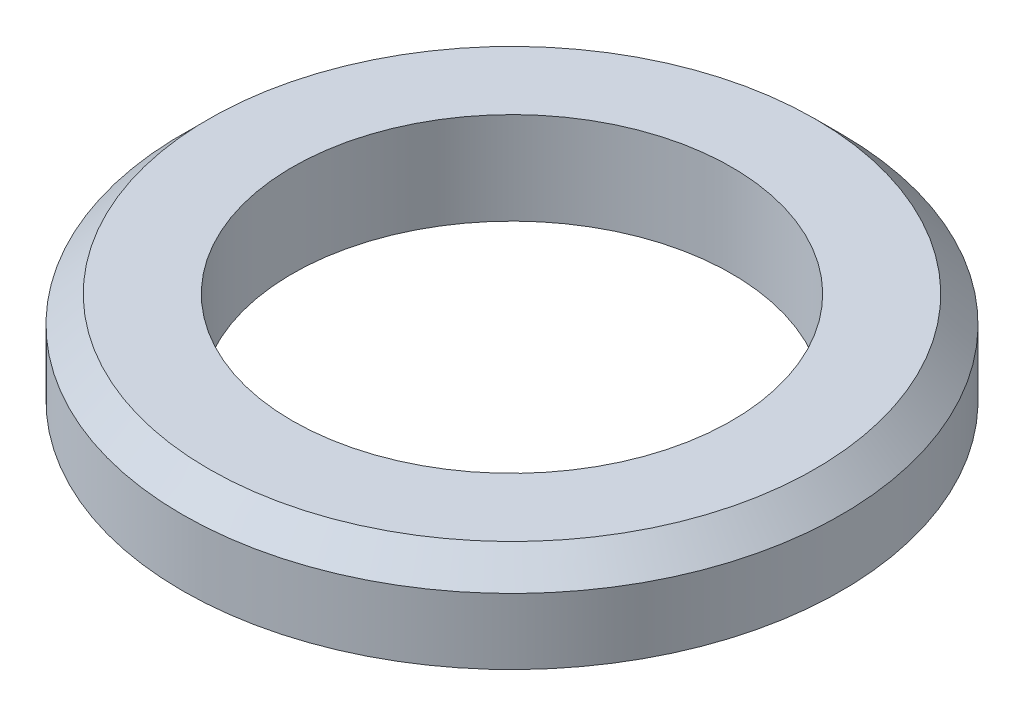
ISO-10303-21;
HEADER;
FILE_DESCRIPTION(('STEP AP214'),'2;1');
FILE_NAME('part.step','',(''),(''),'','','');
FILE_SCHEMA(('AUTOMOTIVE_DESIGN { 1 0 10303 214 1 1 1 1 }'));
ENDSEC;
DATA;
#1=APPLICATION_CONTEXT('core data for automotive mechanical design processes');
#2=APPLICATION_PROTOCOL_DEFINITION('international standard','automotive_design',2000,#1);
#3=PRODUCT_CONTEXT('',#1,'mechanical');
#4=PRODUCT('Part','Part','',(#3));
#5=PRODUCT_RELATED_PRODUCT_CATEGORY('part','',(#4));
#6=PRODUCT_DEFINITION_FORMATION('','',#4);
#7=PRODUCT_DEFINITION_CONTEXT('part definition',#1,'design');
#8=PRODUCT_DEFINITION('design','',#6,#7);
#9=PRODUCT_DEFINITION_SHAPE('','',#8);
#10=(LENGTH_UNIT() NAMED_UNIT(*) SI_UNIT(.MILLI.,.METRE.));
#11=(NAMED_UNIT(*) PLANE_ANGLE_UNIT() SI_UNIT($,.RADIAN.));
#12=(NAMED_UNIT(*) SI_UNIT($,.STERADIAN.) SOLID_ANGLE_UNIT());
#13=UNCERTAINTY_MEASURE_WITH_UNIT(LENGTH_MEASURE(1.E-05),#10,'distance_accuracy_value','');
#14=(GEOMETRIC_REPRESENTATION_CONTEXT(3) GLOBAL_UNCERTAINTY_ASSIGNED_CONTEXT((#13)) GLOBAL_UNIT_ASSIGNED_CONTEXT((#10,
#11,#12)) REPRESENTATION_CONTEXT('',''));
#15=CARTESIAN_POINT('',(0.,0.,0.));
#16=DIRECTION('',(0.,0.,1.));
#17=DIRECTION('',(1.,0.,0.));
#18=AXIS2_PLACEMENT_3D('',#15,#16,#17);
#19=CARTESIAN_POINT('',(0.,0.21,0.));
#20=DIRECTION('',(0.,1.,0.));
#21=DIRECTION('',(0.,0.,1.));
#22=AXIS2_PLACEMENT_3D('',#19,#20,#21);
#23=PLANE('',#22);
#24=CARTESIAN_POINT('',(0.,0.21,0.));
#25=DIRECTION('',(0.,1.,0.));
#26=DIRECTION('',(0.,0.,1.));
#27=AXIS2_PLACEMENT_3D('',#24,#25,#26);
#28=CIRCLE('',#27,0.69);
#29=CARTESIAN_POINT('',(0.,0.21,0.69));
#30=VERTEX_POINT('',#29);
#31=EDGE_CURVE('E37',#30,#30,#28,.T.);
#32=ORIENTED_EDGE('',*,*,#31,.T.);
#33=EDGE_LOOP('',(#32));
#34=FACE_BOUND('',#33,.T.);
#35=CARTESIAN_POINT('',(0.,0.21,0.));
#36=DIRECTION('',(0.,1.,0.));
#37=DIRECTION('',(0.,0.,1.));
#38=AXIS2_PLACEMENT_3D('',#35,#36,#37);
#39=CIRCLE('',#38,0.5);
#40=CARTESIAN_POINT('',(0.,0.21,0.5));
#41=VERTEX_POINT('',#40);
#42=EDGE_CURVE('E45',#41,#41,#39,.T.);
#43=ORIENTED_EDGE('',*,*,#42,.F.);
#44=EDGE_LOOP('',(#43));
#45=FACE_BOUND('',#44,.T.);
#46=ADVANCED_FACE('F30',(#34,#45),#23,.T.);
#47=CARTESIAN_POINT('',(0.,0.,0.));
#48=DIRECTION('',(0.,1.,0.));
#49=DIRECTION('',(0.,0.,1.));
#50=AXIS2_PLACEMENT_3D('',#47,#48,#49);
#51=PLANE('',#50);
#52=CARTESIAN_POINT('',(0.,0.,0.));
#53=DIRECTION('',(0.,1.,0.));
#54=DIRECTION('',(0.,0.,1.));
#55=AXIS2_PLACEMENT_3D('',#52,#53,#54);
#56=CIRCLE('',#55,0.75);
#57=CARTESIAN_POINT('',(0.,0.,0.75));
#58=VERTEX_POINT('',#57);
#59=EDGE_CURVE('E41',#58,#58,#56,.T.);
#60=ORIENTED_EDGE('',*,*,#59,.F.);
#61=EDGE_LOOP('',(#60));
#62=FACE_BOUND('',#61,.T.);
#63=CARTESIAN_POINT('',(0.,0.,0.));
#64=DIRECTION('',(0.,1.,0.));
#65=DIRECTION('',(0.,0.,1.));
#66=AXIS2_PLACEMENT_3D('',#63,#64,#65);
#67=CIRCLE('',#66,0.5);
#68=CARTESIAN_POINT('',(0.,0.,0.5));
#69=VERTEX_POINT('',#68);
#70=EDGE_CURVE('E48',#69,#69,#67,.T.);
#71=ORIENTED_EDGE('',*,*,#70,.T.);
#72=EDGE_LOOP('',(#71));
#73=FACE_BOUND('',#72,.T.);
#74=ADVANCED_FACE('F58',(#62,#73),#51,.F.);
#75=CARTESIAN_POINT('',(0.,0.21,0.));
#76=DIRECTION('',(0.,-1.,0.));
#77=DIRECTION('',(0.,0.,-1.));
#78=AXIS2_PLACEMENT_3D('',#75,#76,#77);
#79=CYLINDRICAL_SURFACE('',#78,0.75);
#80=CARTESIAN_POINT('',(0.,0.15,0.));
#81=DIRECTION('',(0.,1.,0.));
#82=DIRECTION('',(0.,0.,1.));
#83=AXIS2_PLACEMENT_3D('',#80,#81,#82);
#84=CIRCLE('',#83,0.75);
#85=CARTESIAN_POINT('',(0.,0.15,0.75));
#86=VERTEX_POINT('',#85);
#87=EDGE_CURVE('E10',#86,#86,#84,.F.);
#88=ORIENTED_EDGE('',*,*,#87,.T.);
#89=EDGE_LOOP('',(#88));
#90=FACE_BOUND('',#89,.T.);
#91=ORIENTED_EDGE('',*,*,#59,.T.);
#92=EDGE_LOOP('',(#91));
#93=FACE_BOUND('',#92,.T.);
#94=ADVANCED_FACE('F63',(#90,#93),#79,.T.);
#95=CARTESIAN_POINT('',(0.,0.21,0.));
#96=DIRECTION('',(0.,-1.,0.));
#97=DIRECTION('',(0.,0.,-1.));
#98=AXIS2_PLACEMENT_3D('',#95,#96,#97);
#99=CYLINDRICAL_SURFACE('',#98,0.5);
#100=ORIENTED_EDGE('',*,*,#42,.T.);
#101=EDGE_LOOP('',(#100));
#102=FACE_BOUND('',#101,.T.);
#103=ORIENTED_EDGE('',*,*,#70,.F.);
#104=EDGE_LOOP('',(#103));
#105=FACE_BOUND('',#104,.T.);
#106=ADVANCED_FACE('F54',(#102,#105),#99,.F.);
#107=CARTESIAN_POINT('',(0.,0.21,0.));
#108=DIRECTION('',(0.,-1.,0.));
#109=DIRECTION('',(0.,0.,-1.));
#110=AXIS2_PLACEMENT_3D('',#107,#108,#109);
#111=CONICAL_SURFACE('',#110,0.69,0.785398163397444);
#112=ORIENTED_EDGE('',*,*,#87,.F.);
#113=EDGE_LOOP('',(#112));
#114=FACE_BOUND('',#113,.T.);
#115=ORIENTED_EDGE('',*,*,#31,.F.);
#116=EDGE_LOOP('',(#115));
#117=FACE_BOUND('',#116,.T.);
#118=ADVANCED_FACE('F32',(#114,#117),#111,.T.);
#119=CLOSED_SHELL('',(#46,#74,#94,#106,#118));
#120=MANIFOLD_SOLID_BREP('B2',#119);
#121=ADVANCED_BREP_SHAPE_REPRESENTATION('',(#18,#120),#14);
#122=SHAPE_DEFINITION_REPRESENTATION(#9,#121);
ENDSEC;
END-ISO-10303-21;
